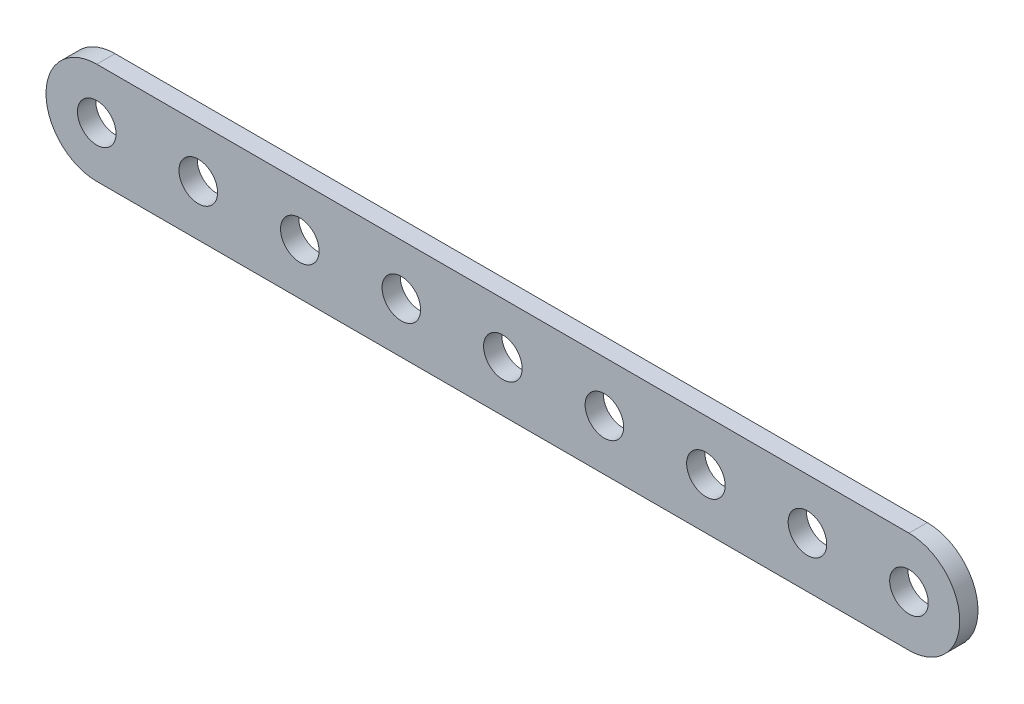
ISO-10303-21;
HEADER;
FILE_DESCRIPTION(('STEP AP214'),'2;1');
FILE_NAME('part.step','',(''),(''),'','','');
FILE_SCHEMA(('AUTOMOTIVE_DESIGN { 1 0 10303 214 1 1 1 1 }'));
ENDSEC;
DATA;
#1=APPLICATION_CONTEXT('core data for automotive mechanical design processes');
#2=APPLICATION_PROTOCOL_DEFINITION('international standard','automotive_design',2000,#1);
#3=PRODUCT_CONTEXT('',#1,'mechanical');
#4=PRODUCT('Part','Part','',(#3));
#5=PRODUCT_RELATED_PRODUCT_CATEGORY('part','',(#4));
#6=PRODUCT_DEFINITION_FORMATION('','',#4);
#7=PRODUCT_DEFINITION_CONTEXT('part definition',#1,'design');
#8=PRODUCT_DEFINITION('design','',#6,#7);
#9=PRODUCT_DEFINITION_SHAPE('','',#8);
#10=(LENGTH_UNIT() NAMED_UNIT(*) SI_UNIT(.MILLI.,.METRE.));
#11=(NAMED_UNIT(*) PLANE_ANGLE_UNIT() SI_UNIT($,.RADIAN.));
#12=(NAMED_UNIT(*) SI_UNIT($,.STERADIAN.) SOLID_ANGLE_UNIT());
#13=UNCERTAINTY_MEASURE_WITH_UNIT(LENGTH_MEASURE(1.E-05),#10,'distance_accuracy_value','');
#14=(GEOMETRIC_REPRESENTATION_CONTEXT(3) GLOBAL_UNCERTAINTY_ASSIGNED_CONTEXT((#13)) GLOBAL_UNIT_ASSIGNED_CONTEXT((#10,
#11,#12)) REPRESENTATION_CONTEXT('',''));
#15=CARTESIAN_POINT('',(0.,0.,0.));
#16=DIRECTION('',(0.,0.,1.));
#17=DIRECTION('',(1.,0.,0.));
#18=AXIS2_PLACEMENT_3D('',#15,#16,#17);
#19=CARTESIAN_POINT('',(-50.8,0.,2.286));
#20=DIRECTION('',(0.,0.,-1.));
#21=DIRECTION('',(-1.,0.,0.));
#22=AXIS2_PLACEMENT_3D('',#19,#20,#21);
#23=CYLINDRICAL_SURFACE('',#22,6.35);
#24=CARTESIAN_POINT('',(-50.8,0.,0.));
#25=DIRECTION('',(0.,0.,1.));
#26=DIRECTION('',(1.,0.,0.));
#27=AXIS2_PLACEMENT_3D('',#24,#25,#26);
#28=CIRCLE('',#27,6.35);
#29=CARTESIAN_POINT('',(-50.8,6.35,0.));
#30=VERTEX_POINT('',#29);
#31=CARTESIAN_POINT('',(-50.8,-6.35,0.));
#32=VERTEX_POINT('',#31);
#33=EDGE_CURVE('E80',#30,#32,#28,.T.);
#34=ORIENTED_EDGE('',*,*,#33,.T.);
#35=DIRECTION('',(0.,0.,-1.));
#36=VECTOR('',#35,1.);
#37=CARTESIAN_POINT('',(-50.8,-6.35,2.286));
#38=LINE('',#37,#36);
#39=CARTESIAN_POINT('',(-50.8,-6.35,2.286));
#40=VERTEX_POINT('',#39);
#41=EDGE_CURVE('E11',#40,#32,#38,.T.);
#42=ORIENTED_EDGE('',*,*,#41,.F.);
#43=CARTESIAN_POINT('',(-50.8,0.,2.286));
#44=DIRECTION('',(0.,0.,1.));
#45=DIRECTION('',(1.,0.,0.));
#46=AXIS2_PLACEMENT_3D('',#43,#44,#45);
#47=CIRCLE('',#46,6.35);
#48=CARTESIAN_POINT('',(-50.8,6.35,2.286));
#49=VERTEX_POINT('',#48);
#50=EDGE_CURVE('E103',#49,#40,#47,.T.);
#51=ORIENTED_EDGE('',*,*,#50,.F.);
#52=DIRECTION('',(0.,0.,-1.));
#53=VECTOR('',#52,1.);
#54=CARTESIAN_POINT('',(-50.8,6.35,2.286));
#55=LINE('',#54,#53);
#56=EDGE_CURVE('E92',#49,#30,#55,.T.);
#57=ORIENTED_EDGE('',*,*,#56,.T.);
#58=EDGE_LOOP('',(#34,#42,#51,#57));
#59=FACE_BOUND('',#58,.T.);
#60=ADVANCED_FACE('F36',(#59),#23,.T.);
#61=CARTESIAN_POINT('',(-50.8,-6.35,2.286));
#62=DIRECTION('',(0.,1.,0.));
#63=DIRECTION('',(0.,0.,1.));
#64=AXIS2_PLACEMENT_3D('',#61,#62,#63);
#65=PLANE('',#64);
#66=DIRECTION('',(1.,0.,0.));
#67=VECTOR('',#66,1.);
#68=CARTESIAN_POINT('',(-50.8,-6.35,0.));
#69=LINE('',#68,#67);
#70=CARTESIAN_POINT('',(50.8,-6.35,0.));
#71=VERTEX_POINT('',#70);
#72=EDGE_CURVE('E76',#32,#71,#69,.T.);
#73=ORIENTED_EDGE('',*,*,#72,.T.);
#74=DIRECTION('',(0.,0.,-1.));
#75=VECTOR('',#74,1.);
#76=CARTESIAN_POINT('',(50.8,-6.35,2.286));
#77=LINE('',#76,#75);
#78=CARTESIAN_POINT('',(50.8,-6.35,2.286));
#79=VERTEX_POINT('',#78);
#80=EDGE_CURVE('E43',#79,#71,#77,.T.);
#81=ORIENTED_EDGE('',*,*,#80,.F.);
#82=DIRECTION('',(1.,0.,0.));
#83=VECTOR('',#82,1.);
#84=CARTESIAN_POINT('',(-50.8,-6.35,2.286));
#85=LINE('',#84,#83);
#86=EDGE_CURVE('E88',#40,#79,#85,.T.);
#87=ORIENTED_EDGE('',*,*,#86,.F.);
#88=ORIENTED_EDGE('',*,*,#41,.T.);
#89=EDGE_LOOP('',(#73,#81,#87,#88));
#90=FACE_BOUND('',#89,.T.);
#91=ADVANCED_FACE('F87',(#90),#65,.F.);
#92=CARTESIAN_POINT('',(50.8,0.,2.286));
#93=DIRECTION('',(0.,0.,-1.));
#94=DIRECTION('',(-1.,0.,0.));
#95=AXIS2_PLACEMENT_3D('',#92,#93,#94);
#96=CYLINDRICAL_SURFACE('',#95,6.35);
#97=CARTESIAN_POINT('',(50.8,0.,0.));
#98=DIRECTION('',(0.,0.,1.));
#99=DIRECTION('',(-1.,0.,0.));
#100=AXIS2_PLACEMENT_3D('',#97,#98,#99);
#101=CIRCLE('',#100,6.35);
#102=CARTESIAN_POINT('',(50.8,6.35,0.));
#103=VERTEX_POINT('',#102);
#104=EDGE_CURVE('E81',#71,#103,#101,.T.);
#105=ORIENTED_EDGE('',*,*,#104,.T.);
#106=DIRECTION('',(0.,0.,-1.));
#107=VECTOR('',#106,1.);
#108=CARTESIAN_POINT('',(50.8,6.35,2.286));
#109=LINE('',#108,#107);
#110=CARTESIAN_POINT('',(50.8,6.35,2.286));
#111=VERTEX_POINT('',#110);
#112=EDGE_CURVE('E109',#111,#103,#109,.T.);
#113=ORIENTED_EDGE('',*,*,#112,.F.);
#114=CARTESIAN_POINT('',(50.8,0.,2.286));
#115=DIRECTION('',(0.,0.,1.));
#116=DIRECTION('',(-1.,0.,0.));
#117=AXIS2_PLACEMENT_3D('',#114,#115,#116);
#118=CIRCLE('',#117,6.35);
#119=EDGE_CURVE('E55',#79,#111,#118,.T.);
#120=ORIENTED_EDGE('',*,*,#119,.F.);
#121=ORIENTED_EDGE('',*,*,#80,.T.);
#122=EDGE_LOOP('',(#105,#113,#120,#121));
#123=FACE_BOUND('',#122,.T.);
#124=ADVANCED_FACE('F112',(#123),#96,.T.);
#125=CARTESIAN_POINT('',(-50.8,6.35,2.286));
#126=DIRECTION('',(0.,-1.,0.));
#127=DIRECTION('',(0.,0.,-1.));
#128=AXIS2_PLACEMENT_3D('',#125,#126,#127);
#129=PLANE('',#128);
#130=DIRECTION('',(-1.,0.,0.));
#131=VECTOR('',#130,1.);
#132=CARTESIAN_POINT('',(-50.8,6.35,0.));
#133=LINE('',#132,#131);
#134=EDGE_CURVE('E101',#103,#30,#133,.T.);
#135=ORIENTED_EDGE('',*,*,#134,.T.);
#136=ORIENTED_EDGE('',*,*,#56,.F.);
#137=DIRECTION('',(-1.,0.,0.));
#138=VECTOR('',#137,1.);
#139=CARTESIAN_POINT('',(-50.8,6.35,2.286));
#140=LINE('',#139,#138);
#141=EDGE_CURVE('E50',#111,#49,#140,.T.);
#142=ORIENTED_EDGE('',*,*,#141,.F.);
#143=ORIENTED_EDGE('',*,*,#112,.T.);
#144=EDGE_LOOP('',(#135,#136,#142,#143));
#145=FACE_BOUND('',#144,.T.);
#146=ADVANCED_FACE('F114',(#145),#129,.F.);
#147=CARTESIAN_POINT('',(-50.8,0.,2.286));
#148=DIRECTION('',(0.,0.,1.));
#149=DIRECTION('',(1.,0.,0.));
#150=AXIS2_PLACEMENT_3D('',#147,#148,#149);
#151=PLANE('',#150);
#152=CARTESIAN_POINT('',(50.8,0.,2.286));
#153=DIRECTION('',(0.,0.,1.));
#154=DIRECTION('',(1.,0.,0.));
#155=AXIS2_PLACEMENT_3D('',#152,#153,#154);
#156=CIRCLE('',#155,2.413);
#157=CARTESIAN_POINT('',(53.213,0.,2.286));
#158=VERTEX_POINT('',#157);
#159=EDGE_CURVE('E251',#158,#158,#156,.T.);
#160=ORIENTED_EDGE('',*,*,#159,.F.);
#161=EDGE_LOOP('',(#160));
#162=FACE_BOUND('',#161,.T.);
#163=CARTESIAN_POINT('',(38.1,0.,2.286));
#164=DIRECTION('',(0.,0.,1.));
#165=DIRECTION('',(1.,0.,0.));
#166=AXIS2_PLACEMENT_3D('',#163,#164,#165);
#167=CIRCLE('',#166,2.413);
#168=CARTESIAN_POINT('',(40.513,0.,2.286));
#169=VERTEX_POINT('',#168);
#170=EDGE_CURVE('E253',#169,#169,#167,.T.);
#171=ORIENTED_EDGE('',*,*,#170,.F.);
#172=EDGE_LOOP('',(#171));
#173=FACE_BOUND('',#172,.T.);
#174=CARTESIAN_POINT('',(25.4,0.,2.286));
#175=DIRECTION('',(0.,0.,1.));
#176=DIRECTION('',(1.,0.,0.));
#177=AXIS2_PLACEMENT_3D('',#174,#175,#176);
#178=CIRCLE('',#177,2.413);
#179=CARTESIAN_POINT('',(27.813,0.,2.286));
#180=VERTEX_POINT('',#179);
#181=EDGE_CURVE('E261',#180,#180,#178,.T.);
#182=ORIENTED_EDGE('',*,*,#181,.F.);
#183=EDGE_LOOP('',(#182));
#184=FACE_BOUND('',#183,.T.);
#185=CARTESIAN_POINT('',(12.7,0.,2.286));
#186=DIRECTION('',(0.,0.,1.));
#187=DIRECTION('',(1.,0.,0.));
#188=AXIS2_PLACEMENT_3D('',#185,#186,#187);
#189=CIRCLE('',#188,2.413);
#190=CARTESIAN_POINT('',(15.113,0.,2.286));
#191=VERTEX_POINT('',#190);
#192=EDGE_CURVE('E267',#191,#191,#189,.T.);
#193=ORIENTED_EDGE('',*,*,#192,.F.);
#194=EDGE_LOOP('',(#193));
#195=FACE_BOUND('',#194,.T.);
#196=CARTESIAN_POINT('',(0.,0.,2.286));
#197=DIRECTION('',(0.,0.,1.));
#198=DIRECTION('',(1.,0.,0.));
#199=AXIS2_PLACEMENT_3D('',#196,#197,#198);
#200=CIRCLE('',#199,2.413);
#201=CARTESIAN_POINT('',(2.413,0.,2.286));
#202=VERTEX_POINT('',#201);
#203=EDGE_CURVE('E273',#202,#202,#200,.T.);
#204=ORIENTED_EDGE('',*,*,#203,.F.);
#205=EDGE_LOOP('',(#204));
#206=FACE_BOUND('',#205,.T.);
#207=CARTESIAN_POINT('',(-12.7,0.,2.286));
#208=DIRECTION('',(0.,0.,1.));
#209=DIRECTION('',(1.,0.,0.));
#210=AXIS2_PLACEMENT_3D('',#207,#208,#209);
#211=CIRCLE('',#210,2.413);
#212=CARTESIAN_POINT('',(-10.287,0.,2.286));
#213=VERTEX_POINT('',#212);
#214=EDGE_CURVE('E279',#213,#213,#211,.T.);
#215=ORIENTED_EDGE('',*,*,#214,.F.);
#216=EDGE_LOOP('',(#215));
#217=FACE_BOUND('',#216,.T.);
#218=CARTESIAN_POINT('',(-25.4,0.,2.286));
#219=DIRECTION('',(0.,0.,1.));
#220=DIRECTION('',(1.,0.,0.));
#221=AXIS2_PLACEMENT_3D('',#218,#219,#220);
#222=CIRCLE('',#221,2.413);
#223=CARTESIAN_POINT('',(-22.987,0.,2.286));
#224=VERTEX_POINT('',#223);
#225=EDGE_CURVE('E285',#224,#224,#222,.T.);
#226=ORIENTED_EDGE('',*,*,#225,.F.);
#227=EDGE_LOOP('',(#226));
#228=FACE_BOUND('',#227,.T.);
#229=CARTESIAN_POINT('',(-38.1,0.,2.286));
#230=DIRECTION('',(0.,0.,1.));
#231=DIRECTION('',(1.,0.,0.));
#232=AXIS2_PLACEMENT_3D('',#229,#230,#231);
#233=CIRCLE('',#232,2.413);
#234=CARTESIAN_POINT('',(-35.687,0.,2.286));
#235=VERTEX_POINT('',#234);
#236=EDGE_CURVE('E291',#235,#235,#233,.T.);
#237=ORIENTED_EDGE('',*,*,#236,.F.);
#238=EDGE_LOOP('',(#237));
#239=FACE_BOUND('',#238,.T.);
#240=CARTESIAN_POINT('',(-50.8,0.,2.286));
#241=DIRECTION('',(0.,0.,1.));
#242=DIRECTION('',(1.,0.,0.));
#243=AXIS2_PLACEMENT_3D('',#240,#241,#242);
#244=CIRCLE('',#243,2.413);
#245=CARTESIAN_POINT('',(-48.387,0.,2.286));
#246=VERTEX_POINT('',#245);
#247=EDGE_CURVE('E96',#246,#246,#244,.T.);
#248=ORIENTED_EDGE('',*,*,#247,.F.);
#249=EDGE_LOOP('',(#248));
#250=FACE_BOUND('',#249,.T.);
#251=ORIENTED_EDGE('',*,*,#50,.T.);
#252=ORIENTED_EDGE('',*,*,#86,.T.);
#253=ORIENTED_EDGE('',*,*,#119,.T.);
#254=ORIENTED_EDGE('',*,*,#141,.T.);
#255=EDGE_LOOP('',(#251,#252,#253,#254));
#256=FACE_BOUND('',#255,.T.);
#257=ADVANCED_FACE('F115',(#162,#173,#184,#195,#206,#217,#228,#239,#250,#256),#151,.T.);
#258=CARTESIAN_POINT('',(-50.8,0.,0.));
#259=DIRECTION('',(0.,0.,1.));
#260=DIRECTION('',(1.,0.,0.));
#261=AXIS2_PLACEMENT_3D('',#258,#259,#260);
#262=PLANE('',#261);
#263=CARTESIAN_POINT('',(50.8,0.,0.));
#264=DIRECTION('',(0.,0.,1.));
#265=DIRECTION('',(1.,0.,0.));
#266=AXIS2_PLACEMENT_3D('',#263,#264,#265);
#267=CIRCLE('',#266,2.413);
#268=CARTESIAN_POINT('',(53.213,0.,0.));
#269=VERTEX_POINT('',#268);
#270=EDGE_CURVE('E249',#269,#269,#267,.T.);
#271=ORIENTED_EDGE('',*,*,#270,.T.);
#272=EDGE_LOOP('',(#271));
#273=FACE_BOUND('',#272,.T.);
#274=CARTESIAN_POINT('',(38.1,0.,0.));
#275=DIRECTION('',(0.,0.,1.));
#276=DIRECTION('',(1.,0.,0.));
#277=AXIS2_PLACEMENT_3D('',#274,#275,#276);
#278=CIRCLE('',#277,2.413);
#279=CARTESIAN_POINT('',(40.513,0.,0.));
#280=VERTEX_POINT('',#279);
#281=EDGE_CURVE('E258',#280,#280,#278,.T.);
#282=ORIENTED_EDGE('',*,*,#281,.T.);
#283=EDGE_LOOP('',(#282));
#284=FACE_BOUND('',#283,.T.);
#285=CARTESIAN_POINT('',(25.4,0.,0.));
#286=DIRECTION('',(0.,0.,1.));
#287=DIRECTION('',(1.,0.,0.));
#288=AXIS2_PLACEMENT_3D('',#285,#286,#287);
#289=CIRCLE('',#288,2.413);
#290=CARTESIAN_POINT('',(27.813,0.,0.));
#291=VERTEX_POINT('',#290);
#292=EDGE_CURVE('E264',#291,#291,#289,.T.);
#293=ORIENTED_EDGE('',*,*,#292,.T.);
#294=EDGE_LOOP('',(#293));
#295=FACE_BOUND('',#294,.T.);
#296=CARTESIAN_POINT('',(12.7,0.,0.));
#297=DIRECTION('',(0.,0.,1.));
#298=DIRECTION('',(1.,0.,0.));
#299=AXIS2_PLACEMENT_3D('',#296,#297,#298);
#300=CIRCLE('',#299,2.413);
#301=CARTESIAN_POINT('',(15.113,0.,0.));
#302=VERTEX_POINT('',#301);
#303=EDGE_CURVE('E270',#302,#302,#300,.T.);
#304=ORIENTED_EDGE('',*,*,#303,.T.);
#305=EDGE_LOOP('',(#304));
#306=FACE_BOUND('',#305,.T.);
#307=CARTESIAN_POINT('',(0.,0.,0.));
#308=DIRECTION('',(0.,0.,1.));
#309=DIRECTION('',(1.,0.,0.));
#310=AXIS2_PLACEMENT_3D('',#307,#308,#309);
#311=CIRCLE('',#310,2.413);
#312=CARTESIAN_POINT('',(2.413,0.,0.));
#313=VERTEX_POINT('',#312);
#314=EDGE_CURVE('E276',#313,#313,#311,.T.);
#315=ORIENTED_EDGE('',*,*,#314,.T.);
#316=EDGE_LOOP('',(#315));
#317=FACE_BOUND('',#316,.T.);
#318=CARTESIAN_POINT('',(-12.7,0.,0.));
#319=DIRECTION('',(0.,0.,1.));
#320=DIRECTION('',(1.,0.,0.));
#321=AXIS2_PLACEMENT_3D('',#318,#319,#320);
#322=CIRCLE('',#321,2.413);
#323=CARTESIAN_POINT('',(-10.287,0.,0.));
#324=VERTEX_POINT('',#323);
#325=EDGE_CURVE('E282',#324,#324,#322,.T.);
#326=ORIENTED_EDGE('',*,*,#325,.T.);
#327=EDGE_LOOP('',(#326));
#328=FACE_BOUND('',#327,.T.);
#329=CARTESIAN_POINT('',(-25.4,0.,0.));
#330=DIRECTION('',(0.,0.,1.));
#331=DIRECTION('',(1.,0.,0.));
#332=AXIS2_PLACEMENT_3D('',#329,#330,#331);
#333=CIRCLE('',#332,2.413);
#334=CARTESIAN_POINT('',(-22.987,0.,0.));
#335=VERTEX_POINT('',#334);
#336=EDGE_CURVE('E288',#335,#335,#333,.T.);
#337=ORIENTED_EDGE('',*,*,#336,.T.);
#338=EDGE_LOOP('',(#337));
#339=FACE_BOUND('',#338,.T.);
#340=CARTESIAN_POINT('',(-38.1,0.,0.));
#341=DIRECTION('',(0.,0.,1.));
#342=DIRECTION('',(1.,0.,0.));
#343=AXIS2_PLACEMENT_3D('',#340,#341,#342);
#344=CIRCLE('',#343,2.413);
#345=CARTESIAN_POINT('',(-35.687,0.,0.));
#346=VERTEX_POINT('',#345);
#347=EDGE_CURVE('E294',#346,#346,#344,.T.);
#348=ORIENTED_EDGE('',*,*,#347,.T.);
#349=EDGE_LOOP('',(#348));
#350=FACE_BOUND('',#349,.T.);
#351=CARTESIAN_POINT('',(-50.8,0.,0.));
#352=DIRECTION('',(0.,0.,1.));
#353=DIRECTION('',(1.,0.,0.));
#354=AXIS2_PLACEMENT_3D('',#351,#352,#353);
#355=CIRCLE('',#354,2.413);
#356=CARTESIAN_POINT('',(-48.387,0.,0.));
#357=VERTEX_POINT('',#356);
#358=EDGE_CURVE('E93',#357,#357,#355,.T.);
#359=ORIENTED_EDGE('',*,*,#358,.T.);
#360=EDGE_LOOP('',(#359));
#361=FACE_BOUND('',#360,.T.);
#362=ORIENTED_EDGE('',*,*,#33,.F.);
#363=ORIENTED_EDGE('',*,*,#134,.F.);
#364=ORIENTED_EDGE('',*,*,#104,.F.);
#365=ORIENTED_EDGE('',*,*,#72,.F.);
#366=EDGE_LOOP('',(#362,#363,#364,#365));
#367=FACE_BOUND('',#366,.T.);
#368=ADVANCED_FACE('F77',(#273,#284,#295,#306,#317,#328,#339,#350,#361,#367),#262,.F.);
#369=CARTESIAN_POINT('',(-50.8,0.,0.));
#370=DIRECTION('',(0.,0.,1.));
#371=DIRECTION('',(1.,0.,0.));
#372=AXIS2_PLACEMENT_3D('',#369,#370,#371);
#373=CYLINDRICAL_SURFACE('',#372,2.413);
#374=ORIENTED_EDGE('',*,*,#358,.F.);
#375=EDGE_LOOP('',(#374));
#376=FACE_BOUND('',#375,.T.);
#377=ORIENTED_EDGE('',*,*,#247,.T.);
#378=EDGE_LOOP('',(#377));
#379=FACE_BOUND('',#378,.T.);
#380=ADVANCED_FACE('F123',(#376,#379),#373,.F.);
#381=CARTESIAN_POINT('',(-38.1,0.,0.));
#382=DIRECTION('',(0.,0.,1.));
#383=DIRECTION('',(1.,0.,0.));
#384=AXIS2_PLACEMENT_3D('',#381,#382,#383);
#385=CYLINDRICAL_SURFACE('',#384,2.413);
#386=ORIENTED_EDGE('',*,*,#347,.F.);
#387=EDGE_LOOP('',(#386));
#388=FACE_BOUND('',#387,.T.);
#389=ORIENTED_EDGE('',*,*,#236,.T.);
#390=EDGE_LOOP('',(#389));
#391=FACE_BOUND('',#390,.T.);
#392=ADVANCED_FACE('F152',(#388,#391),#385,.F.);
#393=CARTESIAN_POINT('',(-25.4,0.,0.));
#394=DIRECTION('',(0.,0.,1.));
#395=DIRECTION('',(1.,0.,0.));
#396=AXIS2_PLACEMENT_3D('',#393,#394,#395);
#397=CYLINDRICAL_SURFACE('',#396,2.413);
#398=ORIENTED_EDGE('',*,*,#336,.F.);
#399=EDGE_LOOP('',(#398));
#400=FACE_BOUND('',#399,.T.);
#401=ORIENTED_EDGE('',*,*,#225,.T.);
#402=EDGE_LOOP('',(#401));
#403=FACE_BOUND('',#402,.T.);
#404=ADVANCED_FACE('F172',(#400,#403),#397,.F.);
#405=CARTESIAN_POINT('',(-12.7,0.,0.));
#406=DIRECTION('',(0.,0.,1.));
#407=DIRECTION('',(1.,0.,0.));
#408=AXIS2_PLACEMENT_3D('',#405,#406,#407);
#409=CYLINDRICAL_SURFACE('',#408,2.413);
#410=ORIENTED_EDGE('',*,*,#325,.F.);
#411=EDGE_LOOP('',(#410));
#412=FACE_BOUND('',#411,.T.);
#413=ORIENTED_EDGE('',*,*,#214,.T.);
#414=EDGE_LOOP('',(#413));
#415=FACE_BOUND('',#414,.T.);
#416=ADVANCED_FACE('F182',(#412,#415),#409,.F.);
#417=CARTESIAN_POINT('',(0.,0.,0.));
#418=DIRECTION('',(0.,0.,1.));
#419=DIRECTION('',(1.,0.,0.));
#420=AXIS2_PLACEMENT_3D('',#417,#418,#419);
#421=CYLINDRICAL_SURFACE('',#420,2.413);
#422=ORIENTED_EDGE('',*,*,#314,.F.);
#423=EDGE_LOOP('',(#422));
#424=FACE_BOUND('',#423,.T.);
#425=ORIENTED_EDGE('',*,*,#203,.T.);
#426=EDGE_LOOP('',(#425));
#427=FACE_BOUND('',#426,.T.);
#428=ADVANCED_FACE('F192',(#424,#427),#421,.F.);
#429=CARTESIAN_POINT('',(12.7,0.,0.));
#430=DIRECTION('',(0.,0.,1.));
#431=DIRECTION('',(1.,0.,0.));
#432=AXIS2_PLACEMENT_3D('',#429,#430,#431);
#433=CYLINDRICAL_SURFACE('',#432,2.413);
#434=ORIENTED_EDGE('',*,*,#303,.F.);
#435=EDGE_LOOP('',(#434));
#436=FACE_BOUND('',#435,.T.);
#437=ORIENTED_EDGE('',*,*,#192,.T.);
#438=EDGE_LOOP('',(#437));
#439=FACE_BOUND('',#438,.T.);
#440=ADVANCED_FACE('F202',(#436,#439),#433,.F.);
#441=CARTESIAN_POINT('',(25.4,0.,0.));
#442=DIRECTION('',(0.,0.,1.));
#443=DIRECTION('',(1.,0.,0.));
#444=AXIS2_PLACEMENT_3D('',#441,#442,#443);
#445=CYLINDRICAL_SURFACE('',#444,2.413);
#446=ORIENTED_EDGE('',*,*,#292,.F.);
#447=EDGE_LOOP('',(#446));
#448=FACE_BOUND('',#447,.T.);
#449=ORIENTED_EDGE('',*,*,#181,.T.);
#450=EDGE_LOOP('',(#449));
#451=FACE_BOUND('',#450,.T.);
#452=ADVANCED_FACE('F212',(#448,#451),#445,.F.);
#453=CARTESIAN_POINT('',(38.1,0.,0.));
#454=DIRECTION('',(0.,0.,1.));
#455=DIRECTION('',(1.,0.,0.));
#456=AXIS2_PLACEMENT_3D('',#453,#454,#455);
#457=CYLINDRICAL_SURFACE('',#456,2.413);
#458=ORIENTED_EDGE('',*,*,#281,.F.);
#459=EDGE_LOOP('',(#458));
#460=FACE_BOUND('',#459,.T.);
#461=ORIENTED_EDGE('',*,*,#170,.T.);
#462=EDGE_LOOP('',(#461));
#463=FACE_BOUND('',#462,.T.);
#464=ADVANCED_FACE('F222',(#460,#463),#457,.F.);
#465=CARTESIAN_POINT('',(50.8,0.,0.));
#466=DIRECTION('',(0.,0.,1.));
#467=DIRECTION('',(1.,0.,0.));
#468=AXIS2_PLACEMENT_3D('',#465,#466,#467);
#469=CYLINDRICAL_SURFACE('',#468,2.413);
#470=ORIENTED_EDGE('',*,*,#270,.F.);
#471=EDGE_LOOP('',(#470));
#472=FACE_BOUND('',#471,.T.);
#473=ORIENTED_EDGE('',*,*,#159,.T.);
#474=EDGE_LOOP('',(#473));
#475=FACE_BOUND('',#474,.T.);
#476=ADVANCED_FACE('F232',(#472,#475),#469,.F.);
#477=CLOSED_SHELL('',(#60,#91,#124,#146,#257,#368,#380,#392,#404,#416,#428,#440,#452,#464,#476));
#478=MANIFOLD_SOLID_BREP('B2',#477);
#479=ADVANCED_BREP_SHAPE_REPRESENTATION('',(#18,#478),#14);
#480=SHAPE_DEFINITION_REPRESENTATION(#9,#479);
ENDSEC;
END-ISO-10303-21;
